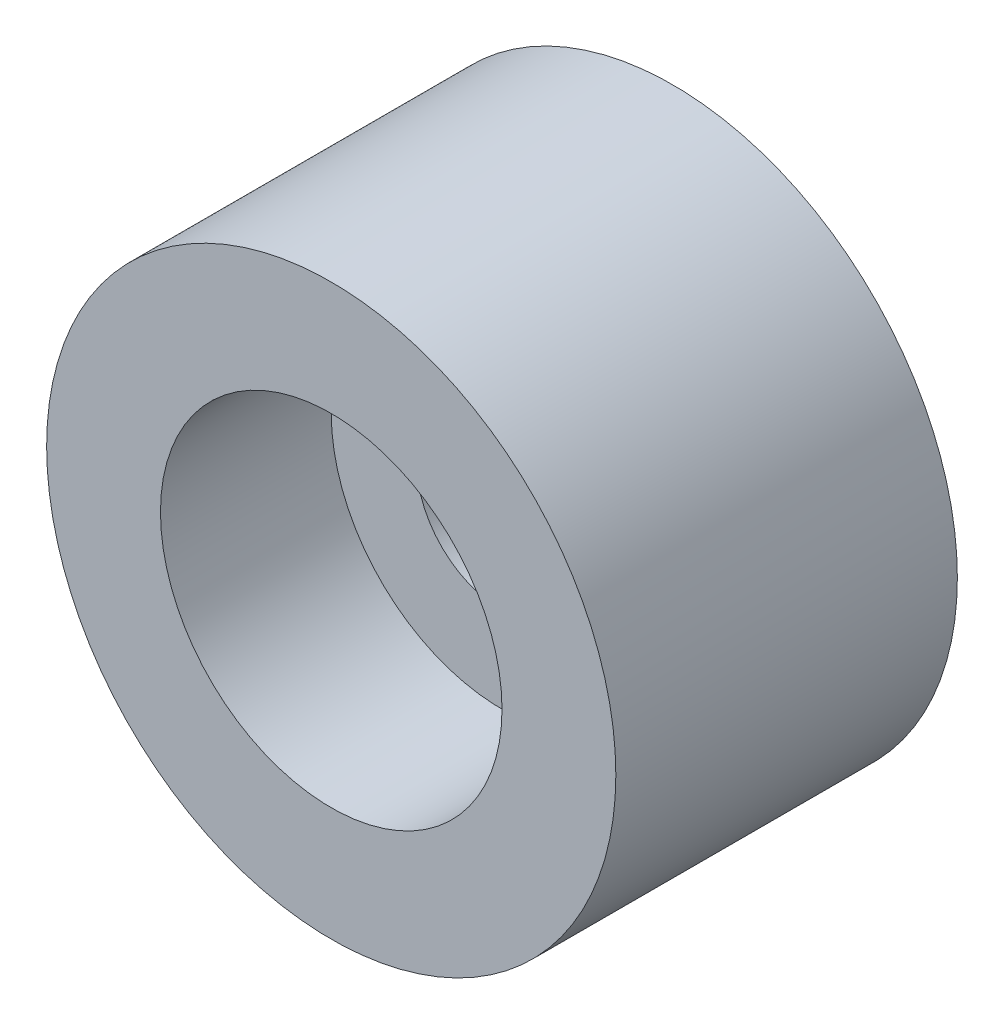
ISO-10303-21;
HEADER;
FILE_DESCRIPTION(('STEP AP214'),'2;1');
FILE_NAME('part.step','',(''),(''),'','','');
FILE_SCHEMA(('AUTOMOTIVE_DESIGN { 1 0 10303 214 1 1 1 1 }'));
ENDSEC;
DATA;
#1=APPLICATION_CONTEXT('core data for automotive mechanical design processes');
#2=APPLICATION_PROTOCOL_DEFINITION('international standard','automotive_design',2000,#1);
#3=PRODUCT_CONTEXT('',#1,'mechanical');
#4=PRODUCT('Part','Part','',(#3));
#5=PRODUCT_RELATED_PRODUCT_CATEGORY('part','',(#4));
#6=PRODUCT_DEFINITION_FORMATION('','',#4);
#7=PRODUCT_DEFINITION_CONTEXT('part definition',#1,'design');
#8=PRODUCT_DEFINITION('design','',#6,#7);
#9=PRODUCT_DEFINITION_SHAPE('','',#8);
#10=(LENGTH_UNIT() NAMED_UNIT(*) SI_UNIT(.MILLI.,.METRE.));
#11=(NAMED_UNIT(*) PLANE_ANGLE_UNIT() SI_UNIT($,.RADIAN.));
#12=(NAMED_UNIT(*) SI_UNIT($,.STERADIAN.) SOLID_ANGLE_UNIT());
#13=UNCERTAINTY_MEASURE_WITH_UNIT(LENGTH_MEASURE(1.E-05),#10,'distance_accuracy_value','');
#14=(GEOMETRIC_REPRESENTATION_CONTEXT(3) GLOBAL_UNCERTAINTY_ASSIGNED_CONTEXT((#13)) GLOBAL_UNIT_ASSIGNED_CONTEXT((#10,
#11,#12)) REPRESENTATION_CONTEXT('',''));
#15=CARTESIAN_POINT('',(0.,0.,0.));
#16=DIRECTION('',(0.,0.,1.));
#17=DIRECTION('',(1.,0.,0.));
#18=AXIS2_PLACEMENT_3D('',#15,#16,#17);
#19=CARTESIAN_POINT('',(0.,0.,3.));
#20=DIRECTION('',(0.,0.,-1.));
#21=DIRECTION('',(-1.,0.,0.));
#22=AXIS2_PLACEMENT_3D('',#19,#20,#21);
#23=CYLINDRICAL_SURFACE('',#22,0.75);
#24=CARTESIAN_POINT('',(0.,0.,0.));
#25=DIRECTION('',(0.,0.,1.));
#26=DIRECTION('',(1.,0.,0.));
#27=AXIS2_PLACEMENT_3D('',#24,#25,#26);
#28=CIRCLE('',#27,0.75);
#29=CARTESIAN_POINT('',(0.75,0.,0.));
#30=VERTEX_POINT('',#29);
#31=EDGE_CURVE('E47',#30,#30,#28,.T.);
#32=ORIENTED_EDGE('',*,*,#31,.F.);
#33=EDGE_LOOP('',(#32));
#34=FACE_BOUND('',#33,.T.);
#35=CARTESIAN_POINT('',(0.,0.,1.5));
#36=DIRECTION('',(0.,0.,1.));
#37=DIRECTION('',(1.,0.,0.));
#38=AXIS2_PLACEMENT_3D('',#35,#36,#37);
#39=CIRCLE('',#38,0.75);
#40=CARTESIAN_POINT('',(0.75,0.,1.5));
#41=VERTEX_POINT('',#40);
#42=EDGE_CURVE('E38',#41,#41,#39,.T.);
#43=ORIENTED_EDGE('',*,*,#42,.T.);
#44=EDGE_LOOP('',(#43));
#45=FACE_BOUND('',#44,.T.);
#46=ADVANCED_FACE('F34',(#34,#45),#23,.F.);
#47=CARTESIAN_POINT('',(0.,0.,3.));
#48=DIRECTION('',(0.,0.,1.));
#49=DIRECTION('',(1.,0.,0.));
#50=AXIS2_PLACEMENT_3D('',#47,#48,#49);
#51=PLANE('',#50);
#52=CARTESIAN_POINT('',(0.,0.,3.));
#53=DIRECTION('',(0.,0.,1.));
#54=DIRECTION('',(1.,0.,0.));
#55=AXIS2_PLACEMENT_3D('',#52,#53,#54);
#56=CIRCLE('',#55,1.5);
#57=CARTESIAN_POINT('',(1.5,0.,3.));
#58=VERTEX_POINT('',#57);
#59=EDGE_CURVE('E51',#58,#58,#56,.T.);
#60=ORIENTED_EDGE('',*,*,#59,.F.);
#61=EDGE_LOOP('',(#60));
#62=FACE_BOUND('',#61,.T.);
#63=CARTESIAN_POINT('',(0.,0.,3.));
#64=DIRECTION('',(0.,0.,1.));
#65=DIRECTION('',(1.,0.,0.));
#66=AXIS2_PLACEMENT_3D('',#63,#64,#65);
#67=CIRCLE('',#66,2.5);
#68=CARTESIAN_POINT('',(2.5,0.,3.));
#69=VERTEX_POINT('',#68);
#70=EDGE_CURVE('E10',#69,#69,#67,.T.);
#71=ORIENTED_EDGE('',*,*,#70,.T.);
#72=EDGE_LOOP('',(#71));
#73=FACE_BOUND('',#72,.T.);
#74=ADVANCED_FACE('F72',(#62,#73),#51,.T.);
#75=CARTESIAN_POINT('',(0.,0.,0.));
#76=DIRECTION('',(0.,0.,1.));
#77=DIRECTION('',(1.,0.,0.));
#78=AXIS2_PLACEMENT_3D('',#75,#76,#77);
#79=PLANE('',#78);
#80=CARTESIAN_POINT('',(0.,0.,0.));
#81=DIRECTION('',(0.,0.,1.));
#82=DIRECTION('',(1.,0.,0.));
#83=AXIS2_PLACEMENT_3D('',#80,#81,#82);
#84=CIRCLE('',#83,2.5);
#85=CARTESIAN_POINT('',(2.5,0.,0.));
#86=VERTEX_POINT('',#85);
#87=EDGE_CURVE('E42',#86,#86,#84,.T.);
#88=ORIENTED_EDGE('',*,*,#87,.F.);
#89=EDGE_LOOP('',(#88));
#90=FACE_BOUND('',#89,.T.);
#91=ORIENTED_EDGE('',*,*,#31,.T.);
#92=EDGE_LOOP('',(#91));
#93=FACE_BOUND('',#92,.T.);
#94=ADVANCED_FACE('F78',(#90,#93),#79,.F.);
#95=CARTESIAN_POINT('',(0.,0.,3.));
#96=DIRECTION('',(0.,0.,-1.));
#97=DIRECTION('',(-1.,0.,0.));
#98=AXIS2_PLACEMENT_3D('',#95,#96,#97);
#99=CYLINDRICAL_SURFACE('',#98,2.5);
#100=ORIENTED_EDGE('',*,*,#70,.F.);
#101=EDGE_LOOP('',(#100));
#102=FACE_BOUND('',#101,.T.);
#103=ORIENTED_EDGE('',*,*,#87,.T.);
#104=EDGE_LOOP('',(#103));
#105=FACE_BOUND('',#104,.T.);
#106=ADVANCED_FACE('F36',(#102,#105),#99,.T.);
#107=CARTESIAN_POINT('',(0.,0.,1.5));
#108=DIRECTION('',(0.,0.,1.));
#109=DIRECTION('',(1.,0.,0.));
#110=AXIS2_PLACEMENT_3D('',#107,#108,#109);
#111=CYLINDRICAL_SURFACE('',#110,1.5);
#112=CARTESIAN_POINT('',(0.,0.,1.5));
#113=DIRECTION('',(0.,0.,1.));
#114=DIRECTION('',(1.,0.,0.));
#115=AXIS2_PLACEMENT_3D('',#112,#113,#114);
#116=CIRCLE('',#115,1.5);
#117=CARTESIAN_POINT('',(1.5,0.,1.5));
#118=VERTEX_POINT('',#117);
#119=EDGE_CURVE('E54',#118,#118,#116,.T.);
#120=ORIENTED_EDGE('',*,*,#119,.F.);
#121=EDGE_LOOP('',(#120));
#122=FACE_BOUND('',#121,.T.);
#123=ORIENTED_EDGE('',*,*,#59,.T.);
#124=EDGE_LOOP('',(#123));
#125=FACE_BOUND('',#124,.T.);
#126=ADVANCED_FACE('F64',(#122,#125),#111,.F.);
#127=CARTESIAN_POINT('',(0.,0.,1.5));
#128=DIRECTION('',(0.,0.,1.));
#129=DIRECTION('',(1.,0.,0.));
#130=AXIS2_PLACEMENT_3D('',#127,#128,#129);
#131=PLANE('',#130);
#132=ORIENTED_EDGE('',*,*,#42,.F.);
#133=EDGE_LOOP('',(#132));
#134=FACE_BOUND('',#133,.T.);
#135=ORIENTED_EDGE('',*,*,#119,.T.);
#136=EDGE_LOOP('',(#135));
#137=FACE_BOUND('',#136,.T.);
#138=ADVANCED_FACE('F62',(#134,#137),#131,.T.);
#139=CLOSED_SHELL('',(#46,#74,#94,#106,#126,#138));
#140=MANIFOLD_SOLID_BREP('B2',#139);
#141=ADVANCED_BREP_SHAPE_REPRESENTATION('',(#18,#140),#14);
#142=SHAPE_DEFINITION_REPRESENTATION(#9,#141);
ENDSEC;
END-ISO-10303-21;
